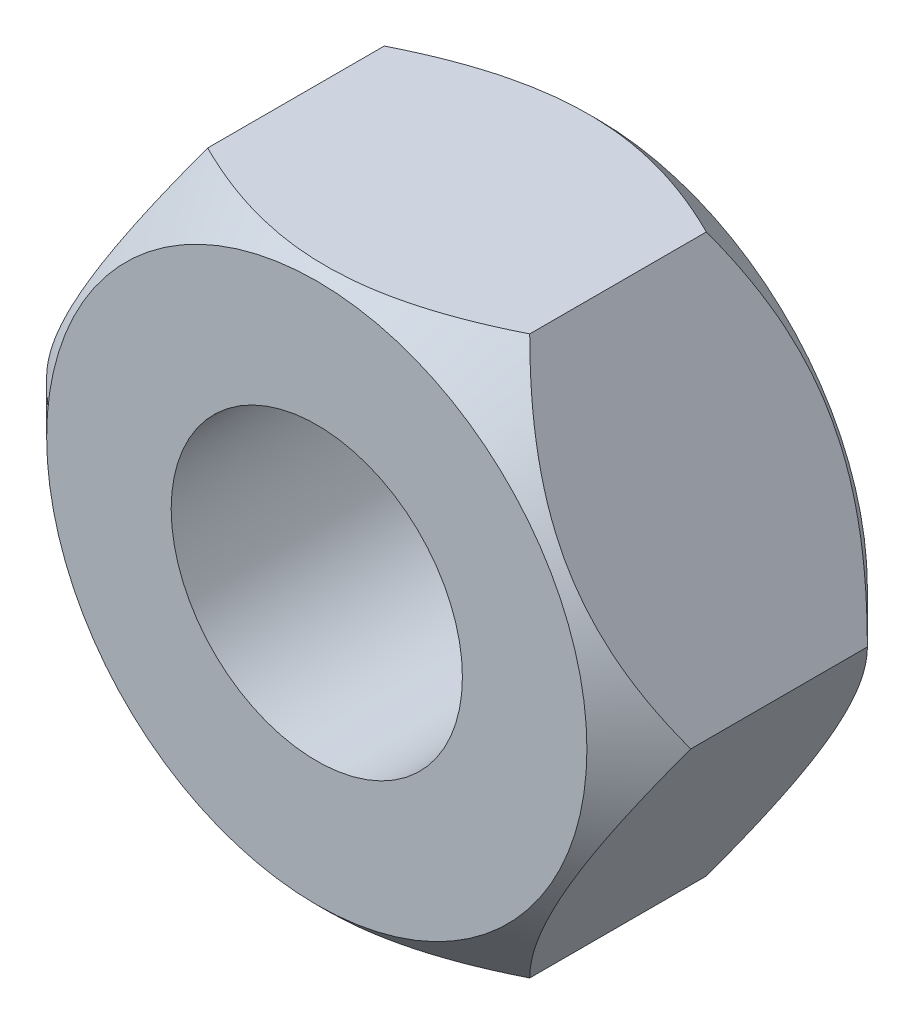
ISO-10303-21;
HEADER;
FILE_DESCRIPTION(('STEP AP214'),'2;1');
FILE_NAME('part.step','',(''),(''),'','','');
FILE_SCHEMA(('AUTOMOTIVE_DESIGN { 1 0 10303 214 1 1 1 1 }'));
ENDSEC;
DATA;
#1=APPLICATION_CONTEXT('core data for automotive mechanical design processes');
#2=APPLICATION_PROTOCOL_DEFINITION('international standard','automotive_design',2000,#1);
#3=PRODUCT_CONTEXT('',#1,'mechanical');
#4=PRODUCT('Part','Part','',(#3));
#5=PRODUCT_RELATED_PRODUCT_CATEGORY('part','',(#4));
#6=PRODUCT_DEFINITION_FORMATION('','',#4);
#7=PRODUCT_DEFINITION_CONTEXT('part definition',#1,'design');
#8=PRODUCT_DEFINITION('design','',#6,#7);
#9=PRODUCT_DEFINITION_SHAPE('','',#8);
#10=(LENGTH_UNIT() NAMED_UNIT(*) SI_UNIT(.MILLI.,.METRE.));
#11=(NAMED_UNIT(*) PLANE_ANGLE_UNIT() SI_UNIT($,.RADIAN.));
#12=(NAMED_UNIT(*) SI_UNIT($,.STERADIAN.) SOLID_ANGLE_UNIT());
#13=UNCERTAINTY_MEASURE_WITH_UNIT(LENGTH_MEASURE(1.E-05),#10,'distance_accuracy_value','');
#14=(GEOMETRIC_REPRESENTATION_CONTEXT(3) GLOBAL_UNCERTAINTY_ASSIGNED_CONTEXT((#13)) GLOBAL_UNIT_ASSIGNED_CONTEXT((#10,
#11,#12)) REPRESENTATION_CONTEXT('',''));
#15=CARTESIAN_POINT('',(0.,0.,0.));
#16=DIRECTION('',(0.,0.,1.));
#17=DIRECTION('',(1.,0.,0.));
#18=AXIS2_PLACEMENT_3D('',#15,#16,#17);
#19=CARTESIAN_POINT('',(0.,12.7305734356312,-3.2));
#20=DIRECTION('',(0.,0.,-1.));
#21=DIRECTION('',(-1.,0.,0.));
#22=AXIS2_PLACEMENT_3D('',#19,#20,#21);
#23=PLANE('',#22);
#24=CARTESIAN_POINT('',(0.,0.,-3.2));
#25=DIRECTION('',(0.,0.,-1.));
#26=DIRECTION('',(-1.,0.,0.));
#27=AXIS2_PLACEMENT_3D('',#24,#25,#26);
#28=CIRCLE('',#27,3.32350000000001);
#29=CARTESIAN_POINT('',(-3.32350000000001,0.,-3.2));
#30=VERTEX_POINT('',#29);
#31=EDGE_CURVE('E437',#30,#30,#28,.T.);
#32=ORIENTED_EDGE('',*,*,#31,.F.);
#33=EDGE_LOOP('',(#32));
#34=FACE_BOUND('',#33,.T.);
#35=CARTESIAN_POINT('',(0.,0.,-3.2));
#36=DIRECTION('',(0.,0.,-1.));
#37=DIRECTION('',(-1.,0.,0.));
#38=AXIS2_PLACEMENT_3D('',#35,#36,#37);
#39=CIRCLE('',#38,6.16528671781563);
#40=CARTESIAN_POINT('',(-6.16528671781562,0.,-3.2));
#41=VERTEX_POINT('',#40);
#42=EDGE_CURVE('E52',#41,#41,#39,.F.);
#43=ORIENTED_EDGE('',*,*,#42,.F.);
#44=EDGE_LOOP('',(#43));
#45=FACE_BOUND('',#44,.T.);
#46=ADVANCED_FACE('F48',(#34,#45),#23,.T.);
#47=CARTESIAN_POINT('',(0.,0.,-4.41421356237309));
#48=DIRECTION('',(0.,0.,1.));
#49=DIRECTION('',(1.,0.,0.));
#50=AXIS2_PLACEMENT_3D('',#47,#48,#49);
#51=CONICAL_SURFACE('',#50,4.95107315544253,0.785398163397448);
#52=CARTESIAN_POINT('',(-7.76238511153342,-6.36528671781563,0.673214047724806));
#53=CARTESIAN_POINT('',(-7.57520229334684,-6.36528671781563,0.52850517565176));
#54=CARTESIAN_POINT('',(-7.38702153666975,-6.36528671781563,0.385067057126823));
#55=CARTESIAN_POINT('',(-7.00825250574306,-6.36528671781563,0.101315942705855));
#56=CARTESIAN_POINT('',(-6.81766368110091,-6.36528671781563,-0.0389963177212883));
#57=CARTESIAN_POINT('',(-6.43227537100412,-6.36528671781563,-0.316910199211171));
#58=CARTESIAN_POINT('',(-6.23745476162188,-6.36528671781563,-0.454482622167092));
#59=CARTESIAN_POINT('',(-5.84458969450331,-6.36528671781563,-0.724928509042763));
#60=CARTESIAN_POINT('',(-5.64654545877006,-6.36528671781563,-0.857802294563289));
#61=CARTESIAN_POINT('',(-5.23365974744603,-6.36528671781563,-1.12624119504319));
#62=CARTESIAN_POINT('',(-5.01856443197393,-6.36528671781563,-1.26141783143151));
#63=CARTESIAN_POINT('',(-4.58331700025617,-6.36528671781563,-1.52350958302549));
#64=CARTESIAN_POINT('',(-4.36316402834724,-6.36528671781563,-1.65042328615959));
#65=CARTESIAN_POINT('',(-3.91771948944952,-6.36528671781563,-1.89329624370996));
#66=CARTESIAN_POINT('',(-3.6924455771355,-6.36528671781563,-2.00928762484668));
#67=CARTESIAN_POINT('',(-3.23547185904979,-6.36528671781563,-2.22771689283654));
#68=CARTESIAN_POINT('',(-3.00377518046011,-6.36528671781563,-2.3301612401241));
#69=CARTESIAN_POINT('',(-2.55769774177556,-6.36528671781563,-2.50807699856079));
#70=CARTESIAN_POINT('',(-2.34399906607956,-6.36528671781562,-2.58524123881317));
#71=CARTESIAN_POINT('',(-1.91107784413825,-6.36528671781562,-2.72247186545491));
#72=CARTESIAN_POINT('',(-1.69185495373321,-6.36528671781562,-2.78253718369693));
#73=CARTESIAN_POINT('',(-1.25306100869839,-6.36528671781562,-2.88128416305542));
#74=CARTESIAN_POINT('',(-1.03358025662511,-6.36528671781562,-2.9203602947243));
#75=CARTESIAN_POINT('',(-0.591790167533705,-6.36528671781562,-2.97629990355305));
#76=CARTESIAN_POINT('',(-0.36948145787447,-6.36528671781562,-2.99316822346708));
#77=CARTESIAN_POINT('',(0.0654621048721111,-6.36528671781562,-3.00320617566351));
#78=CARTESIAN_POINT('',(0.278072838541162,-6.36528671781562,-2.99742760010155));
#79=CARTESIAN_POINT('',(0.701676425638989,-6.36528671781562,-2.96492714161134));
#80=CARTESIAN_POINT('',(0.912669133491356,-6.36528671781562,-2.93820339602699));
#81=CARTESIAN_POINT('',(1.33508891098892,-6.36528671781562,-2.86488380431923));
#82=CARTESIAN_POINT('',(1.5464534075807,-6.36528671781562,-2.81793360487504));
#83=CARTESIAN_POINT('',(1.96451234475091,-6.36528671781562,-2.70679337960762));
#84=CARTESIAN_POINT('',(2.17120701451626,-6.36528671781562,-2.64260420184455));
#85=CARTESIAN_POINT('',(2.58952534362606,-6.36528671781562,-2.49635484461017));
#86=CARTESIAN_POINT('',(2.80089358398573,-6.36528671781562,-2.41357260180954));
#87=CARTESIAN_POINT('',(3.21820401991109,-6.36528671781562,-2.2352027972607));
#88=CARTESIAN_POINT('',(3.42414373808872,-6.36528671781562,-2.13960950605476));
#89=CARTESIAN_POINT('',(3.83156235741431,-6.36528671781562,-1.9378833447665));
#90=CARTESIAN_POINT('',(4.03302513083261,-6.36528671781562,-1.83171816708422));
#91=CARTESIAN_POINT('',(4.43133833300465,-6.36528671781562,-1.61118216748763));
#92=CARTESIAN_POINT('',(4.62818946059477,-6.36528671781562,-1.49681259965485));
#93=CARTESIAN_POINT('',(5.00827074323468,-6.36528671781562,-1.26727075127695));
#94=CARTESIAN_POINT('',(5.19169384661193,-6.36528671781562,-1.15241627076983));
#95=CARTESIAN_POINT('',(5.55538833501125,-6.36528671781562,-0.917806765919314));
#96=CARTESIAN_POINT('',(5.73565948292346,-6.36528671781562,-0.798051375143196));
#97=CARTESIAN_POINT('',(6.09201602604293,-6.36528671781562,-0.555485277573426));
#98=CARTESIAN_POINT('',(6.26812337930183,-6.36528671781562,-0.432706713539862));
#99=CARTESIAN_POINT('',(6.6179203573018,-6.36528671781562,-0.183849413140996));
#100=CARTESIAN_POINT('',(6.79161063531104,-6.36528671781562,-0.0577715960910986));
#101=CARTESIAN_POINT('',(6.96428662494657,-6.36528671781562,0.0696570125099407));
#102=B_SPLINE_CURVE_WITH_KNOTS('',3,(#52,#53,#54,#55,#56,#57,#58,#59,#60,#61,#62,#63,#64,#65,
#66,#67,#68,#69,#70,#71,#72,#73,#74,#75,#76,#77,#78,#79,#80,#81,#82,#83,#84,#85,#86,#87,#88,#89,
#90,#91,#92,#93,#94,#95,#96,#97,#98,#99,#100,#101),.UNSPECIFIED.,.F.,.F.,(4,2,2,2,2,2,2,2,2,2,2,
2,2,2,2,2,2,2,2,2,2,2,2,2,4),(0.,0.709803276707006,1.41977183266255,2.13520817681282,
2.85059545737842,3.61258204363045,4.37469850755869,5.13449828098337,5.89393439723402,
6.57496032504066,7.2560287863172,7.92380464147173,8.59143485372003,9.22843407884403,
9.86548995880247,10.5141919379485,11.162862010473,11.8433450682876,12.5241334790443,
13.2070702408519,13.88990283393,14.5390575260462,15.1882608433485,15.8322658485392,
16.4760932775642),.UNSPECIFIED.);
#103=CARTESIAN_POINT('',(3.675,-6.36528671781562,-2.01528671781563));
#104=VERTEX_POINT('',#103);
#105=CARTESIAN_POINT('',(-3.675,-6.36528671781562,-2.01528671781562));
#106=VERTEX_POINT('',#105);
#107=EDGE_CURVE('E100',#104,#106,#102,.F.);
#108=ORIENTED_EDGE('',*,*,#107,.T.);
#109=CARTESIAN_POINT('',(-3.67488452994616,-6.36548671781563,-2.01517124504074));
#110=CARTESIAN_POINT('',(-3.73807356401795,-6.25604010032207,-2.07835377232718));
#111=CARTESIAN_POINT('',(-3.80174829849817,-6.14575222504388,-2.13959731862921));
#112=CARTESIAN_POINT('',(-3.93016445452812,-5.92332891828732,-2.25761662143914));
#113=CARTESIAN_POINT('',(-3.99490643564212,-5.8111925176152,-2.31438993784469));
#114=CARTESIAN_POINT('',(-4.19147763596966,-5.4707212113431,-2.47760393260829));
#115=CARTESIAN_POINT('',(-4.32497092023566,-5.23950406052515,-2.57624238755673));
#116=CARTESIAN_POINT('',(-4.59417079829745,-4.77323619433079,-2.74515392307455));
#117=CARTESIAN_POINT('',(-4.72980858778119,-4.53830465151862,-2.81585254576234));
#118=CARTESIAN_POINT('',(-4.93549518694531,-4.1820450113303,-2.89763346727766));
#119=CARTESIAN_POINT('',(-5.00436021084379,-4.0627672910737,-2.92083833579857));
#120=CARTESIAN_POINT('',(-5.14267334083861,-3.82320192256878,-2.95863396667905));
#121=CARTESIAN_POINT('',(-5.21212135822206,-3.70291442797573,-2.97322601637104));
#122=CARTESIAN_POINT('',(-5.3813568074318,-3.40979003150271,-2.99769169950192));
#123=CARTESIAN_POINT('',(-5.48132658374675,-3.23663729970392,-3.00282504103294));
#124=CARTESIAN_POINT('',(-5.6810859539133,-2.8906439212875,-2.99420887105415));
#125=CARTESIAN_POINT('',(-5.78087547232866,-2.71780340532926,-2.98045274040005));
#126=CARTESIAN_POINT('',(-5.97951370766255,-2.37375188940515,-2.93486849774483));
#127=CARTESIAN_POINT('',(-6.07836124658407,-2.20254292978993,-2.90302017596468));
#128=CARTESIAN_POINT('',(-6.27435737582576,-1.86306767585649,-2.82298302590451));
#129=CARTESIAN_POINT('',(-6.37150609582014,-1.69480115693594,-2.77479545060811));
#130=CARTESIAN_POINT('',(-6.54396205260882,-1.39609867771004,-2.6756590707861));
#131=CARTESIAN_POINT('',(-6.61965116767066,-1.26500128484302,-2.62731757439736));
#132=CARTESIAN_POINT('',(-6.76967069700655,-1.00515983790569,-2.52284454499592));
#133=CARTESIAN_POINT('',(-6.8440010700074,-0.876415855322655,-2.46671277578916));
#134=CARTESIAN_POINT('',(-6.99106899949014,-0.621686729294596,-2.34791745948314));
#135=CARTESIAN_POINT('',(-7.0638107386559,-0.495694341228572,-2.2852744534155));
#136=CARTESIAN_POINT('',(-7.20794725011016,-0.246042580164072,-2.15427908651923));
#137=CARTESIAN_POINT('',(-7.27934281597615,-0.122381832649047,-2.08593022708493));
#138=CARTESIAN_POINT('',(-7.35011547005384,0.000200000000004609,-2.01517124504074));
#139=B_SPLINE_CURVE_WITH_KNOTS('',3,(#109,#110,#111,#112,#113,#114,#115,#116,#117,#118,#119,
#120,#121,#122,#123,#124,#125,#126,#127,#128,#129,#130,#131,#132,#133,#134,#135,#136,#137,#138),
.UNSPECIFIED.,.F.,.F.,(4,2,2,2,2,2,2,2,2,2,2,2,2,2,4),(0.,0.423851395527622,0.847932571714284,
1.70067337750543,2.53987353572585,2.95865059939789,3.37736505384643,3.97644909130097,
4.5757431100471,5.17570788684627,5.77562666545544,6.25213187254105,6.72865152999374,
7.20371108313857,7.67848122942596),.UNSPECIFIED.);
#140=CARTESIAN_POINT('',(-7.35,0.,-2.01528671781563));
#141=VERTEX_POINT('',#140);
#142=EDGE_CURVE('E72',#106,#141,#139,.T.);
#143=ORIENTED_EDGE('',*,*,#142,.T.);
#144=CARTESIAN_POINT('',(-7.35011547005384,-0.000199999999995818,-2.01517124504074));
#145=CARTESIAN_POINT('',(-7.28692643598204,0.109246617493558,-2.07835377232718));
#146=CARTESIAN_POINT('',(-7.22325170150182,0.219534492771754,-2.13959731862922));
#147=CARTESIAN_POINT('',(-7.09483554547187,0.441957799528313,-2.25761662143915));
#148=CARTESIAN_POINT('',(-7.03009356435787,0.554094200200429,-2.31438993784469));
#149=CARTESIAN_POINT('',(-6.83352236403033,0.894565506472534,-2.47760393260829));
#150=CARTESIAN_POINT('',(-6.70002907976433,1.12578265729048,-2.57624238755673));
#151=CARTESIAN_POINT('',(-6.43082920170254,1.59205052348484,-2.74515392307456));
#152=CARTESIAN_POINT('',(-6.2951914122188,1.82698206629701,-2.81585254576234));
#153=CARTESIAN_POINT('',(-6.08950481305468,2.18324170648532,-2.89763346727766));
#154=CARTESIAN_POINT('',(-6.0206397891562,2.30251942674193,-2.92083833579857));
#155=CARTESIAN_POINT('',(-5.88232665916138,2.54208479524684,-2.95863396667905));
#156=CARTESIAN_POINT('',(-5.81287864177793,2.6623722898399,-2.97322601637104));
#157=CARTESIAN_POINT('',(-5.64364319256819,2.95549668631292,-2.99769169950192));
#158=CARTESIAN_POINT('',(-5.54367341625324,3.12864941811171,-3.00282504103294));
#159=CARTESIAN_POINT('',(-5.34391404608669,3.47464279652813,-2.99420887105415));
#160=CARTESIAN_POINT('',(-5.24412452767133,3.64748331248636,-2.98045274040005));
#161=CARTESIAN_POINT('',(-5.04548629233744,3.99153482841048,-2.93486849774483));
#162=CARTESIAN_POINT('',(-4.94663875341592,4.1627437880257,-2.90302017596469));
#163=CARTESIAN_POINT('',(-4.75064262417423,4.50221904195913,-2.82298302590451));
#164=CARTESIAN_POINT('',(-4.65349390417985,4.67048556087968,-2.77479545060811));
#165=CARTESIAN_POINT('',(-4.48103794739117,4.96918804010558,-2.6756590707861));
#166=CARTESIAN_POINT('',(-4.40534883232934,5.10028543297261,-2.62731757439736));
#167=CARTESIAN_POINT('',(-4.25532930299345,5.36012687990994,-2.52284454499593));
#168=CARTESIAN_POINT('',(-4.18099892999259,5.48887086249297,-2.46671277578916));
#169=CARTESIAN_POINT('',(-4.03393100050985,5.74359998852102,-2.34791745948314));
#170=CARTESIAN_POINT('',(-3.96118926134409,5.86959237658705,-2.2852744534155));
#171=CARTESIAN_POINT('',(-3.81705274988984,6.11924413765155,-2.15427908651924));
#172=CARTESIAN_POINT('',(-3.74565718402385,6.24290488516657,-2.08593022708493));
#173=CARTESIAN_POINT('',(-3.67488452994616,6.36548671781562,-2.01517124504075));
#174=B_SPLINE_CURVE_WITH_KNOTS('',3,(#144,#145,#146,#147,#148,#149,#150,#151,#152,#153,#154,
#155,#156,#157,#158,#159,#160,#161,#162,#163,#164,#165,#166,#167,#168,#169,#170,#171,#172,#173),
.UNSPECIFIED.,.F.,.F.,(4,2,2,2,2,2,2,2,2,2,2,2,2,2,4),(0.,0.423851395527623,0.847932571714286,
1.70067337750543,2.53987353572585,2.95865059939789,3.37736505384643,3.97644909130097,
4.5757431100471,5.17570788684626,5.77562666545544,6.25213187254105,6.72865152999373,
7.20371108313856,7.67848122942594),.UNSPECIFIED.);
#175=CARTESIAN_POINT('',(-3.675,6.36528671781562,-2.01528671781563));
#176=VERTEX_POINT('',#175);
#177=EDGE_CURVE('E194',#141,#176,#174,.T.);
#178=ORIENTED_EDGE('',*,*,#177,.T.);
#179=CARTESIAN_POINT('',(-7.76238375890239,6.36528671781562,0.673213001787473));
#180=CARTESIAN_POINT('',(-7.57520098003128,6.36528671781562,0.528504170242677));
#181=CARTESIAN_POINT('',(-7.38702026278454,6.36528671781562,0.385066092188966));
#182=CARTESIAN_POINT('',(-7.00825131108923,6.36528671781562,0.101315058480191));
#183=CARTESIAN_POINT('',(-6.81766252624821,6.36528671781562,-0.0389971617060863));
#184=CARTESIAN_POINT('',(-6.43227429705411,6.36528671781562,-0.316910962411911));
#185=CARTESIAN_POINT('',(-6.23745372878444,6.36528671781562,-0.454483344837488));
#186=CARTESIAN_POINT('',(-5.84458874459149,6.36528671781562,-0.724929151277076));
#187=CARTESIAN_POINT('',(-5.64654455067117,6.36528671781562,-0.857802896891723));
#188=CARTESIAN_POINT('',(-5.23365892964003,6.36528671781562,-1.12624171403129));
#189=CARTESIAN_POINT('',(-5.01856366277229,6.36528671781562,-1.26141830713973));
#190=CARTESIAN_POINT('',(-4.58331632997627,6.36528671781562,-1.52350997412007));
#191=CARTESIAN_POINT('',(-4.36316340838556,6.36528671781562,-1.65042363592165));
#192=CARTESIAN_POINT('',(-3.91771897192037,6.36528671781562,-1.89329651418357));
#193=CARTESIAN_POINT('',(-3.69244511170579,6.36528671781562,-2.00928785734042));
#194=CARTESIAN_POINT('',(-3.23547150065858,6.36528671781562,-2.22771705412872));
#195=CARTESIAN_POINT('',(-3.00377487700457,6.36528671781562,-2.33016136818822));
#196=CARTESIAN_POINT('',(-2.55769746121548,6.36528671781562,-2.50807710416005));
#197=CARTESIAN_POINT('',(-2.34399875090591,6.36528671781562,-2.58524134889741));
#198=CARTESIAN_POINT('',(-1.91107745835378,6.36528671781562,-2.72247197757596));
#199=CARTESIAN_POINT('',(-1.69185453195287,6.36528671781562,-2.78253729337395));
#200=CARTESIAN_POINT('',(-1.25306051599569,6.36528671781562,-2.88128425948038));
#201=CARTESIAN_POINT('',(-1.03357972902538,6.36528671781562,-2.92036038058372));
#202=CARTESIAN_POINT('',(-0.591789571023439,6.36528671781562,-2.97629996005821));
#203=CARTESIAN_POINT('',(-0.369480827350671,6.36528671781562,-2.99316826118654));
#204=CARTESIAN_POINT('',(0.0654627923157916,6.36528671781562,-3.00320616941619));
#205=CARTESIAN_POINT('',(0.27807354897927,6.36528671781562,-2.99742756972882));
#206=CARTESIAN_POINT('',(0.701677179398343,6.36528671781562,-2.9649270596311));
#207=CARTESIAN_POINT('',(0.912669907577058,6.36528671781562,-2.93820328656141));
#208=CARTESIAN_POINT('',(1.33508972519046,6.36528671781562,-2.86488363762299));
#209=CARTESIAN_POINT('',(1.546454241496,6.36528671781562,-2.81793340824791));
#210=CARTESIAN_POINT('',(1.96451321591809,6.36528671781562,-2.70679312291376));
#211=CARTESIAN_POINT('',(2.17120790322185,6.36528671781562,-2.64260391501559));
#212=CARTESIAN_POINT('',(2.58952633466741,6.36528671781562,-2.49635447306527));
#213=CARTESIAN_POINT('',(2.8008946579818,6.36528671781562,-2.41357217071112));
#214=CARTESIAN_POINT('',(3.21820525559762,6.36528671781562,-2.23520224111253));
#215=CARTESIAN_POINT('',(3.42414505250726,6.36528671781562,-2.1396088844036));
#216=CARTESIAN_POINT('',(3.83156382646067,6.36528671781562,-1.93788258814053));
#217=CARTESIAN_POINT('',(4.03302667575874,6.36528671781562,-1.8317173409637));
#218=CARTESIAN_POINT('',(4.43134002720123,6.36528671781562,-1.61118120019491));
#219=CARTESIAN_POINT('',(4.628191228183,6.36528671781562,-1.49681156068588));
#220=CARTESIAN_POINT('',(5.00827264396825,6.36528671781562,-1.26726957626059));
#221=CARTESIAN_POINT('',(5.19169580734606,6.36528671781562,-1.15241503171182));
#222=CARTESIAN_POINT('',(5.55539041488355,6.36528671781562,-0.91780539850549));
#223=CARTESIAN_POINT('',(5.73566162193332,6.36528671781562,-0.798049943415196));
#224=CARTESIAN_POINT('',(6.09201828188504,6.36528671781562,-0.55548371794631));
#225=CARTESIAN_POINT('',(6.26812569284923,6.36528671781562,-0.432705090336916));
#226=CARTESIAN_POINT('',(6.61792278587736,6.36528671781562,-0.183847662867577));
#227=CARTESIAN_POINT('',(6.79161312120942,6.36528671781562,-0.0577697823227719));
#228=CARTESIAN_POINT('',(6.96428916806874,6.36528671781562,0.0696588896841598));
#229=B_SPLINE_CURVE_WITH_KNOTS('',3,(#179,#180,#181,#182,#183,#184,#185,#186,#187,#188,#189,
#190,#191,#192,#193,#194,#195,#196,#197,#198,#199,#200,#201,#202,#203,#204,#205,#206,#207,#208,
#209,#210,#211,#212,#213,#214,#215,#216,#217,#218,#219,#220,#221,#222,#223,#224,#225,#226,#227,
#228),.UNSPECIFIED.,.F.,.F.,(4,2,2,2,2,2,2,2,2,2,2,2,2,2,2,2,2,2,2,2,2,2,2,2,4),(0.,
0.709803109027238,1.41977149725395,2.13520767051967,2.85059478022713,3.612581173966,
4.37469744526365,5.1344970276959,5.89393295327698,6.57495898293922,7.25602754589564,
7.92380349794466,8.59143380702983,9.22843310276562,9.86548905343174,10.5141911097515,
11.1628612594185,11.8433446137067,12.5241333212899,13.2070703816062,13.8899032730604,
14.5390582197122,15.1882617915671,15.8322670478589,16.4760947279634),.UNSPECIFIED.);
#230=CARTESIAN_POINT('',(3.675,6.36528671781562,-2.01528671781563));
#231=VERTEX_POINT('',#230);
#232=EDGE_CURVE('E191',#176,#231,#229,.T.);
#233=ORIENTED_EDGE('',*,*,#232,.T.);
#234=CARTESIAN_POINT('',(3.67488452994616,6.36548671781562,-2.01517124504075));
#235=CARTESIAN_POINT('',(3.73807356401796,6.25604010032207,-2.07835377232719));
#236=CARTESIAN_POINT('',(3.80174829849818,6.14575222504387,-2.13959731862922));
#237=CARTESIAN_POINT('',(3.93016445452812,5.92332891828732,-2.25761662143915));
#238=CARTESIAN_POINT('',(3.99490643564212,5.8111925176152,-2.31438993784469));
#239=CARTESIAN_POINT('',(4.19147763596967,5.4707212113431,-2.47760393260829));
#240=CARTESIAN_POINT('',(4.32497092023567,5.23950406052515,-2.57624238755673));
#241=CARTESIAN_POINT('',(4.59417079829745,4.77323619433079,-2.74515392307456));
#242=CARTESIAN_POINT('',(4.72980858778119,4.53830465151862,-2.81585254576234));
#243=CARTESIAN_POINT('',(4.93549518694531,4.18204501133031,-2.89763346727767));
#244=CARTESIAN_POINT('',(5.00436021084379,4.0627672910737,-2.92083833579858));
#245=CARTESIAN_POINT('',(5.14267334083861,3.82320192256879,-2.95863396667906));
#246=CARTESIAN_POINT('',(5.21212135822206,3.70291442797573,-2.97322601637105));
#247=CARTESIAN_POINT('',(5.3813568074318,3.40979003150272,-2.99769169950192));
#248=CARTESIAN_POINT('',(5.48132658374675,3.23663729970393,-3.00282504103295));
#249=CARTESIAN_POINT('',(5.6810859539133,2.8906439212875,-2.99420887105415));
#250=CARTESIAN_POINT('',(5.78087547232866,2.71780340532927,-2.98045274040005));
#251=CARTESIAN_POINT('',(5.97951370766255,2.37375188940515,-2.93486849774483));
#252=CARTESIAN_POINT('',(6.07836124658407,2.20254292978993,-2.90302017596469));
#253=CARTESIAN_POINT('',(6.27435737582576,1.8630676758565,-2.82298302590452));
#254=CARTESIAN_POINT('',(6.37150609582014,1.69480115693595,-2.77479545060811));
#255=CARTESIAN_POINT('',(6.54396205260882,1.39609867771005,-2.6756590707861));
#256=CARTESIAN_POINT('',(6.61965116767065,1.26500128484303,-2.62731757439736));
#257=CARTESIAN_POINT('',(6.76967069700655,1.00515983790569,-2.52284454499593));
#258=CARTESIAN_POINT('',(6.8440010700074,0.876415855322662,-2.46671277578917));
#259=CARTESIAN_POINT('',(6.99106899949014,0.621686729294602,-2.34791745948314));
#260=CARTESIAN_POINT('',(7.06381073865591,0.495694341228577,-2.2852744534155));
#261=CARTESIAN_POINT('',(7.20794725011016,0.246042580164075,-2.15427908651924));
#262=CARTESIAN_POINT('',(7.27934281597615,0.122381832649049,-2.08593022708493));
#263=CARTESIAN_POINT('',(7.35011547005384,-0.000200000000002496,-2.01517124504075));
#264=B_SPLINE_CURVE_WITH_KNOTS('',3,(#234,#235,#236,#237,#238,#239,#240,#241,#242,#243,#244,
#245,#246,#247,#248,#249,#250,#251,#252,#253,#254,#255,#256,#257,#258,#259,#260,#261,#262,#263),
.UNSPECIFIED.,.F.,.F.,(4,2,2,2,2,2,2,2,2,2,2,2,2,2,4),(0.,0.423851395527621,0.847932571714284,
1.70067337750543,2.53987353572585,2.95865059939788,3.37736505384642,3.97644909130096,
4.57574311004709,5.17570788684625,5.77562666545543,6.25213187254104,6.72865152999373,
7.20371108313857,7.67848122942595),.UNSPECIFIED.);
#265=CARTESIAN_POINT('',(7.35,0.,-2.01528671781563));
#266=VERTEX_POINT('',#265);
#267=EDGE_CURVE('E195',#231,#266,#264,.T.);
#268=ORIENTED_EDGE('',*,*,#267,.T.);
#269=CARTESIAN_POINT('',(7.35011547005384,0.000199999999998205,-2.01517124504075));
#270=CARTESIAN_POINT('',(7.28692643598204,-0.109246617493556,-2.07835377232719));
#271=CARTESIAN_POINT('',(7.22325170150182,-0.219534492771752,-2.13959731862922));
#272=CARTESIAN_POINT('',(7.09483554547188,-0.441957799528309,-2.25761662143915));
#273=CARTESIAN_POINT('',(7.03009356435787,-0.554094200200424,-2.31438993784469));
#274=CARTESIAN_POINT('',(6.83352236403033,-0.894565506472528,-2.47760393260829));
#275=CARTESIAN_POINT('',(6.70002907976433,-1.12578265729047,-2.57624238755673));
#276=CARTESIAN_POINT('',(6.43082920170255,-1.59205052348483,-2.74515392307456));
#277=CARTESIAN_POINT('',(6.29519141221881,-1.826982066297,-2.81585254576234));
#278=CARTESIAN_POINT('',(6.08950481305468,-2.18324170648531,-2.89763346727766));
#279=CARTESIAN_POINT('',(6.02063978915621,-2.30251942674192,-2.92083833579857));
#280=CARTESIAN_POINT('',(5.88232665916138,-2.54208479524683,-2.95863396667905));
#281=CARTESIAN_POINT('',(5.81287864177794,-2.66237228983989,-2.97322601637104));
#282=CARTESIAN_POINT('',(5.6436431925682,-2.95549668631291,-2.99769169950192));
#283=CARTESIAN_POINT('',(5.54367341625325,-3.12864941811169,-3.00282504103294));
#284=CARTESIAN_POINT('',(5.34391404608669,-3.47464279652812,-2.99420887105415));
#285=CARTESIAN_POINT('',(5.24412452767133,-3.64748331248635,-2.98045274040005));
#286=CARTESIAN_POINT('',(5.04548629233745,-3.99153482841047,-2.93486849774483));
#287=CARTESIAN_POINT('',(4.94663875341593,-4.16274378802569,-2.90302017596469));
#288=CARTESIAN_POINT('',(4.75064262417424,-4.50221904195912,-2.82298302590452));
#289=CARTESIAN_POINT('',(4.65349390417986,-4.67048556087967,-2.77479545060811));
#290=CARTESIAN_POINT('',(4.48103794739118,-4.96918804010557,-2.6756590707861));
#291=CARTESIAN_POINT('',(4.40534883232934,-5.10028543297259,-2.62731757439736));
#292=CARTESIAN_POINT('',(4.25532930299345,-5.36012687990993,-2.52284454499593));
#293=CARTESIAN_POINT('',(4.18099892999259,-5.48887086249296,-2.46671277578916));
#294=CARTESIAN_POINT('',(4.03393100050986,-5.74359998852102,-2.34791745948314));
#295=CARTESIAN_POINT('',(3.96118926134409,-5.86959237658704,-2.2852744534155));
#296=CARTESIAN_POINT('',(3.81705274988984,-6.11924413765154,-2.15427908651923));
#297=CARTESIAN_POINT('',(3.74565718402385,-6.24290488516657,-2.08593022708493));
#298=CARTESIAN_POINT('',(3.67488452994616,-6.36548671781562,-2.01517124504074));
#299=B_SPLINE_CURVE_WITH_KNOTS('',3,(#269,#270,#271,#272,#273,#274,#275,#276,#277,#278,#279,
#280,#281,#282,#283,#284,#285,#286,#287,#288,#289,#290,#291,#292,#293,#294,#295,#296,#297,#298),
.UNSPECIFIED.,.F.,.F.,(4,2,2,2,2,2,2,2,2,2,2,2,2,2,4),(0.,0.42385139552762,0.847932571714281,
1.70067337750543,2.53987353572584,2.95865059939787,3.37736505384642,3.97644909130096,
4.57574311004708,5.17570788684625,5.77562666545542,6.25213187254104,6.72865152999372,
7.20371108313856,7.67848122942594),.UNSPECIFIED.);
#300=EDGE_CURVE('E104',#266,#104,#299,.T.);
#301=ORIENTED_EDGE('',*,*,#300,.T.);
#302=EDGE_LOOP('',(#108,#143,#178,#233,#268,#301));
#303=FACE_BOUND('',#302,.T.);
#304=ORIENTED_EDGE('',*,*,#42,.T.);
#305=EDGE_LOOP('',(#304));
#306=FACE_BOUND('',#305,.T.);
#307=ADVANCED_FACE('F101',(#303,#306),#51,.T.);
#308=CARTESIAN_POINT('',(-7.35,0.,3.2));
#309=DIRECTION('',(-0.866025403784438,0.5,0.));
#310=DIRECTION('',(-0.5,-0.866025403784438,0.));
#311=AXIS2_PLACEMENT_3D('',#308,#309,#310);
#312=PLANE('',#311);
#313=CARTESIAN_POINT('',(-3.67488452994616,6.36548671781562,2.01517124504075));
#314=CARTESIAN_POINT('',(-3.73807356401796,6.25604010032207,2.07835377232719));
#315=CARTESIAN_POINT('',(-3.80174829849818,6.14575222504387,2.13959731862922));
#316=CARTESIAN_POINT('',(-3.93016445452812,5.92332891828731,2.25761662143915));
#317=CARTESIAN_POINT('',(-3.99490643564212,5.8111925176152,2.31438993784469));
#318=CARTESIAN_POINT('',(-4.19147763596967,5.47072121134309,2.47760393260829));
#319=CARTESIAN_POINT('',(-4.32497092023566,5.23950406052515,2.57624238755673));
#320=CARTESIAN_POINT('',(-4.59417079829745,4.77323619433079,2.74515392307456));
#321=CARTESIAN_POINT('',(-4.72980858778119,4.53830465151862,2.81585254576234));
#322=CARTESIAN_POINT('',(-4.93549518694531,4.18204501133031,2.89763346727766));
#323=CARTESIAN_POINT('',(-5.00436021084379,4.0627672910737,2.92083833579857));
#324=CARTESIAN_POINT('',(-5.14267334083861,3.82320192256879,2.95863396667905));
#325=CARTESIAN_POINT('',(-5.21212135822206,3.70291442797573,2.97322601637104));
#326=CARTESIAN_POINT('',(-5.38135680743181,3.40979003150271,2.99769169950192));
#327=CARTESIAN_POINT('',(-5.48132658374675,3.23663729970393,3.00282504103294));
#328=CARTESIAN_POINT('',(-5.68108595391331,2.8906439212875,2.99420887105415));
#329=CARTESIAN_POINT('',(-5.78087547232867,2.71780340532927,2.98045274040005));
#330=CARTESIAN_POINT('',(-5.97951370766255,2.37375188940515,2.93486849774483));
#331=CARTESIAN_POINT('',(-6.07836124658408,2.20254292978993,2.90302017596468));
#332=CARTESIAN_POINT('',(-6.27435737582576,1.8630676758565,2.82298302590451));
#333=CARTESIAN_POINT('',(-6.37150609582014,1.69480115693595,2.77479545060811));
#334=CARTESIAN_POINT('',(-6.54396205260882,1.39609867771005,2.6756590707861));
#335=CARTESIAN_POINT('',(-6.61965116767066,1.26500128484302,2.62731757439736));
#336=CARTESIAN_POINT('',(-6.76967069700655,1.00515983790569,2.52284454499592));
#337=CARTESIAN_POINT('',(-6.84400107000741,0.87641585532266,2.46671277578916));
#338=CARTESIAN_POINT('',(-6.99106899949014,0.621686729294603,2.34791745948314));
#339=CARTESIAN_POINT('',(-7.06381073865591,0.495694341228579,2.2852744534155));
#340=CARTESIAN_POINT('',(-7.20794725011016,0.246042580164081,2.15427908651923));
#341=CARTESIAN_POINT('',(-7.27934281597615,0.122381832649056,2.08593022708493));
#342=CARTESIAN_POINT('',(-7.35011547005384,-0.000199999999995559,2.01517124504074));
#343=B_SPLINE_CURVE_WITH_KNOTS('',3,(#313,#314,#315,#316,#317,#318,#319,#320,#321,#322,#323,
#324,#325,#326,#327,#328,#329,#330,#331,#332,#333,#334,#335,#336,#337,#338,#339,#340,#341,#342),
.UNSPECIFIED.,.F.,.F.,(4,2,2,2,2,2,2,2,2,2,2,2,2,2,4),(0.,0.423851395527621,0.847932571714282,
1.70067337750543,2.53987353572585,2.95865059939788,3.37736505384642,3.97644909130096,
4.57574311004709,5.17570788684626,5.77562666545543,6.25213187254104,6.72865152999372,
7.20371108313856,7.67848122942594),.UNSPECIFIED.);
#344=CARTESIAN_POINT('',(-3.675,6.36528671781562,2.01528671781563));
#345=VERTEX_POINT('',#344);
#346=CARTESIAN_POINT('',(-7.35,0.,2.01528671781563));
#347=VERTEX_POINT('',#346);
#348=EDGE_CURVE('E186',#345,#347,#343,.T.);
#349=ORIENTED_EDGE('',*,*,#348,.F.);
#350=DIRECTION('',(0.,0.,-1.));
#351=VECTOR('',#350,1.);
#352=CARTESIAN_POINT('',(-3.675,6.36528671781562,3.2));
#353=LINE('',#352,#351);
#354=EDGE_CURVE('E144',#345,#176,#353,.T.);
#355=ORIENTED_EDGE('',*,*,#354,.T.);
#356=ORIENTED_EDGE('',*,*,#177,.F.);
#357=DIRECTION('',(0.,0.,-1.));
#358=VECTOR('',#357,1.);
#359=CARTESIAN_POINT('',(-7.35,0.,3.2));
#360=LINE('',#359,#358);
#361=EDGE_CURVE('E117',#347,#141,#360,.T.);
#362=ORIENTED_EDGE('',*,*,#361,.F.);
#363=EDGE_LOOP('',(#349,#355,#356,#362));
#364=FACE_BOUND('',#363,.T.);
#365=ADVANCED_FACE('F163',(#364),#312,.T.);
#366=CARTESIAN_POINT('',(-3.675,6.36528671781562,3.2));
#367=DIRECTION('',(0.,1.,0.));
#368=DIRECTION('',(-1.,0.,0.));
#369=AXIS2_PLACEMENT_3D('',#366,#367,#368);
#370=PLANE('',#369);
#371=CARTESIAN_POINT('',(-7.76238375890239,6.36528671781562,-0.673213001787475));
#372=CARTESIAN_POINT('',(-7.57520098003128,6.36528671781562,-0.528504170242677));
#373=CARTESIAN_POINT('',(-7.38702026278455,6.36528671781562,-0.385066092188965));
#374=CARTESIAN_POINT('',(-7.00825131108923,6.36528671781562,-0.10131505848019));
#375=CARTESIAN_POINT('',(-6.81766252624822,6.36528671781562,0.0389971617060873));
#376=CARTESIAN_POINT('',(-6.43227429705412,6.36528671781562,0.316910962411912));
#377=CARTESIAN_POINT('',(-6.23745372878444,6.36528671781562,0.454483344837489));
#378=CARTESIAN_POINT('',(-5.84458874459149,6.36528671781562,0.724929151277077));
#379=CARTESIAN_POINT('',(-5.64654455067117,6.36528671781562,0.857802896891725));
#380=CARTESIAN_POINT('',(-5.23365892964003,6.36528671781562,1.1262417140313));
#381=CARTESIAN_POINT('',(-5.01856366277229,6.36528671781562,1.26141830713973));
#382=CARTESIAN_POINT('',(-4.58331632997627,6.36528671781562,1.52350997412007));
#383=CARTESIAN_POINT('',(-4.36316340838556,6.36528671781562,1.65042363592165));
#384=CARTESIAN_POINT('',(-3.91771897192037,6.36528671781562,1.89329651418357));
#385=CARTESIAN_POINT('',(-3.69244511170579,6.36528671781562,2.00928785734042));
#386=CARTESIAN_POINT('',(-3.23547150065858,6.36528671781562,2.22771705412872));
#387=CARTESIAN_POINT('',(-3.00377487700457,6.36528671781562,2.33016136818822));
#388=CARTESIAN_POINT('',(-2.55769746121548,6.36528671781562,2.50807710416005));
#389=CARTESIAN_POINT('',(-2.34399875090591,6.36528671781562,2.58524134889742));
#390=CARTESIAN_POINT('',(-1.91107745835379,6.36528671781562,2.72247197757596));
#391=CARTESIAN_POINT('',(-1.69185453195287,6.36528671781562,2.78253729337395));
#392=CARTESIAN_POINT('',(-1.25306051599569,6.36528671781562,2.88128425948038));
#393=CARTESIAN_POINT('',(-1.03357972902538,6.36528671781562,2.92036038058372));
#394=CARTESIAN_POINT('',(-0.591789571023439,6.36528671781562,2.97629996005821));
#395=CARTESIAN_POINT('',(-0.369480827350671,6.36528671781562,2.99316826118654));
#396=CARTESIAN_POINT('',(0.0654627923157924,6.36528671781562,3.00320616941619));
#397=CARTESIAN_POINT('',(0.27807354897927,6.36528671781562,2.99742756972882));
#398=CARTESIAN_POINT('',(0.701677179398343,6.36528671781562,2.96492705963111));
#399=CARTESIAN_POINT('',(0.912669907577059,6.36528671781562,2.93820328656141));
#400=CARTESIAN_POINT('',(1.33508972519047,6.36528671781562,2.86488363762299));
#401=CARTESIAN_POINT('',(1.54645424149601,6.36528671781562,2.81793340824791));
#402=CARTESIAN_POINT('',(1.96451321591809,6.36528671781562,2.70679312291376));
#403=CARTESIAN_POINT('',(2.17120790322185,6.36528671781562,2.64260391501559));
#404=CARTESIAN_POINT('',(2.58952633466741,6.36528671781562,2.49635447306527));
#405=CARTESIAN_POINT('',(2.8008946579818,6.36528671781562,2.41357217071112));
#406=CARTESIAN_POINT('',(3.21820525559762,6.36528671781562,2.23520224111253));
#407=CARTESIAN_POINT('',(3.42414505250726,6.36528671781562,2.1396088844036));
#408=CARTESIAN_POINT('',(3.83156382646067,6.36528671781562,1.93788258814053));
#409=CARTESIAN_POINT('',(4.03302667575874,6.36528671781562,1.8317173409637));
#410=CARTESIAN_POINT('',(4.43134002720123,6.36528671781562,1.61118120019491));
#411=CARTESIAN_POINT('',(4.628191228183,6.36528671781562,1.49681156068588));
#412=CARTESIAN_POINT('',(5.00827264396825,6.36528671781562,1.26726957626059));
#413=CARTESIAN_POINT('',(5.19169580734606,6.36528671781562,1.15241503171182));
#414=CARTESIAN_POINT('',(5.55539041488355,6.36528671781562,0.917805398505491));
#415=CARTESIAN_POINT('',(5.73566162193332,6.36528671781562,0.798049943415198));
#416=CARTESIAN_POINT('',(6.09201828188504,6.36528671781562,0.555483717946312));
#417=CARTESIAN_POINT('',(6.26812569284923,6.36528671781562,0.432705090336917));
#418=CARTESIAN_POINT('',(6.61792278587736,6.36528671781562,0.183847662867577));
#419=CARTESIAN_POINT('',(6.79161312120942,6.36528671781562,0.0577697823227715));
#420=CARTESIAN_POINT('',(6.96428916806874,6.36528671781562,-0.0696588896841601));
#421=B_SPLINE_CURVE_WITH_KNOTS('',3,(#371,#372,#373,#374,#375,#376,#377,#378,#379,#380,#381,
#382,#383,#384,#385,#386,#387,#388,#389,#390,#391,#392,#393,#394,#395,#396,#397,#398,#399,#400,
#401,#402,#403,#404,#405,#406,#407,#408,#409,#410,#411,#412,#413,#414,#415,#416,#417,#418,#419,
#420),.UNSPECIFIED.,.F.,.F.,(4,2,2,2,2,2,2,2,2,2,2,2,2,2,2,2,2,2,2,2,2,2,2,2,4),(0.,
0.709803109027241,1.41977149725395,2.13520767051967,2.85059478022714,3.61258117396601,
4.37469744526366,5.1344970276959,5.89393295327699,6.57495898293923,7.25602754589564,
7.92380349794466,8.59143380702984,9.22843310276563,9.86548905343175,10.5141911097515,
11.1628612594185,11.8433446137068,12.5241333212899,13.2070703816062,13.8899032730605,
14.5390582197122,15.1882617915671,15.8322670478589,16.4760947279634),.UNSPECIFIED.);
#422=CARTESIAN_POINT('',(3.675,6.36528671781562,2.01528671781563));
#423=VERTEX_POINT('',#422);
#424=EDGE_CURVE('E64',#423,#345,#421,.F.);
#425=ORIENTED_EDGE('',*,*,#424,.F.);
#426=DIRECTION('',(0.,0.,-1.));
#427=VECTOR('',#426,1.);
#428=CARTESIAN_POINT('',(3.675,6.36528671781562,3.2));
#429=LINE('',#428,#427);
#430=EDGE_CURVE('E140',#423,#231,#429,.T.);
#431=ORIENTED_EDGE('',*,*,#430,.T.);
#432=ORIENTED_EDGE('',*,*,#232,.F.);
#433=ORIENTED_EDGE('',*,*,#354,.F.);
#434=EDGE_LOOP('',(#425,#431,#432,#433));
#435=FACE_BOUND('',#434,.T.);
#436=ADVANCED_FACE('F170',(#435),#370,.T.);
#437=CARTESIAN_POINT('',(3.675,6.36528671781563,3.2));
#438=DIRECTION('',(0.866025403784439,0.5,0.));
#439=DIRECTION('',(-0.5,0.866025403784439,0.));
#440=AXIS2_PLACEMENT_3D('',#437,#438,#439);
#441=PLANE('',#440);
#442=CARTESIAN_POINT('',(7.35011547005384,-0.000200000000002268,2.01517124504075));
#443=CARTESIAN_POINT('',(7.28692643598204,0.109246617493552,2.07835377232718));
#444=CARTESIAN_POINT('',(7.22325170150182,0.219534492771749,2.13959731862922));
#445=CARTESIAN_POINT('',(7.09483554547188,0.441957799528306,2.25761662143915));
#446=CARTESIAN_POINT('',(7.03009356435788,0.554094200200422,2.31438993784469));
#447=CARTESIAN_POINT('',(6.83352236403033,0.894565506472526,2.47760393260829));
#448=CARTESIAN_POINT('',(6.70002907976433,1.12578265729047,2.57624238755673));
#449=CARTESIAN_POINT('',(6.43082920170254,1.59205052348484,2.74515392307456));
#450=CARTESIAN_POINT('',(6.29519141221881,1.826982066297,2.81585254576234));
#451=CARTESIAN_POINT('',(6.08950481305468,2.18324170648532,2.89763346727767));
#452=CARTESIAN_POINT('',(6.02063978915621,2.30251942674193,2.92083833579858));
#453=CARTESIAN_POINT('',(5.88232665916138,2.54208479524684,2.95863396667906));
#454=CARTESIAN_POINT('',(5.81287864177794,2.66237228983989,2.97322601637105));
#455=CARTESIAN_POINT('',(5.64364319256819,2.95549668631291,2.99769169950192));
#456=CARTESIAN_POINT('',(5.54367341625324,3.1286494181117,3.00282504103295));
#457=CARTESIAN_POINT('',(5.34391404608669,3.47464279652812,2.99420887105415));
#458=CARTESIAN_POINT('',(5.24412452767133,3.64748331248636,2.98045274040005));
#459=CARTESIAN_POINT('',(5.04548629233745,3.99153482841047,2.93486849774483));
#460=CARTESIAN_POINT('',(4.94663875341592,4.16274378802569,2.90302017596469));
#461=CARTESIAN_POINT('',(4.75064262417424,4.50221904195913,2.82298302590452));
#462=CARTESIAN_POINT('',(4.65349390417986,4.67048556087968,2.77479545060811));
#463=CARTESIAN_POINT('',(4.48103794739118,4.96918804010558,2.6756590707861));
#464=CARTESIAN_POINT('',(4.40534883232934,5.1002854329726,2.62731757439736));
#465=CARTESIAN_POINT('',(4.25532930299345,5.36012687990993,2.52284454499593));
#466=CARTESIAN_POINT('',(4.18099892999259,5.48887086249296,2.46671277578917));
#467=CARTESIAN_POINT('',(4.03393100050985,5.74359998852102,2.34791745948315));
#468=CARTESIAN_POINT('',(3.96118926134409,5.86959237658705,2.2852744534155));
#469=CARTESIAN_POINT('',(3.81705274988984,6.11924413765155,2.15427908651924));
#470=CARTESIAN_POINT('',(3.74565718402385,6.24290488516657,2.08593022708494));
#471=CARTESIAN_POINT('',(3.67488452994616,6.36548671781562,2.01517124504075));
#472=B_SPLINE_CURVE_WITH_KNOTS('',3,(#442,#443,#444,#445,#446,#447,#448,#449,#450,#451,#452,
#453,#454,#455,#456,#457,#458,#459,#460,#461,#462,#463,#464,#465,#466,#467,#468,#469,#470,#471),
.UNSPECIFIED.,.F.,.F.,(4,2,2,2,2,2,2,2,2,2,2,2,2,2,4),(0.,0.423851395527622,0.847932571714284,
1.70067337750543,2.53987353572585,2.95865059939788,3.37736505384643,3.97644909130097,
4.57574311004709,5.17570788684626,5.77562666545543,6.25213187254105,6.72865152999373,
7.20371108313857,7.67848122942595),.UNSPECIFIED.);
#473=CARTESIAN_POINT('',(7.35,0.,2.01528671781563));
#474=VERTEX_POINT('',#473);
#475=EDGE_CURVE('E252',#474,#423,#472,.T.);
#476=ORIENTED_EDGE('',*,*,#475,.F.);
#477=DIRECTION('',(0.,0.,-1.));
#478=VECTOR('',#477,1.);
#479=CARTESIAN_POINT('',(7.35,0.,3.2));
#480=LINE('',#479,#478);
#481=EDGE_CURVE('E131',#474,#266,#480,.T.);
#482=ORIENTED_EDGE('',*,*,#481,.T.);
#483=ORIENTED_EDGE('',*,*,#267,.F.);
#484=ORIENTED_EDGE('',*,*,#430,.F.);
#485=EDGE_LOOP('',(#476,#482,#483,#484));
#486=FACE_BOUND('',#485,.T.);
#487=ADVANCED_FACE('F173',(#486),#441,.T.);
#488=CARTESIAN_POINT('',(7.35,0.,3.2));
#489=DIRECTION('',(0.866025403784438,-0.5,0.));
#490=DIRECTION('',(0.5,0.866025403784439,0.));
#491=AXIS2_PLACEMENT_3D('',#488,#489,#490);
#492=PLANE('',#491);
#493=CARTESIAN_POINT('',(3.67488452994616,-6.36548671781562,2.01517124504074));
#494=CARTESIAN_POINT('',(3.73807356401796,-6.25604010032207,2.07835377232718));
#495=CARTESIAN_POINT('',(3.80174829849818,-6.14575222504387,2.13959731862922));
#496=CARTESIAN_POINT('',(3.93016445452812,-5.92332891828731,2.25761662143915));
#497=CARTESIAN_POINT('',(3.99490643564212,-5.8111925176152,2.31438993784469));
#498=CARTESIAN_POINT('',(4.19147763596967,-5.47072121134309,2.47760393260829));
#499=CARTESIAN_POINT('',(4.32497092023567,-5.23950406052515,2.57624238755673));
#500=CARTESIAN_POINT('',(4.59417079829746,-4.77323619433078,2.74515392307456));
#501=CARTESIAN_POINT('',(4.72980858778119,-4.53830465151862,2.81585254576234));
#502=CARTESIAN_POINT('',(4.93549518694532,-4.1820450113303,2.89763346727766));
#503=CARTESIAN_POINT('',(5.00436021084379,-4.06276729107369,2.92083833579857));
#504=CARTESIAN_POINT('',(5.14267334083862,-3.82320192256878,2.95863396667905));
#505=CARTESIAN_POINT('',(5.21212135822206,-3.70291442797573,2.97322601637105));
#506=CARTESIAN_POINT('',(5.38135680743181,-3.40979003150271,2.99769169950192));
#507=CARTESIAN_POINT('',(5.48132658374676,-3.23663729970392,3.00282504103294));
#508=CARTESIAN_POINT('',(5.68108595391331,-2.8906439212875,2.99420887105415));
#509=CARTESIAN_POINT('',(5.78087547232867,-2.71780340532926,2.98045274040005));
#510=CARTESIAN_POINT('',(5.97951370766255,-2.37375188940515,2.93486849774483));
#511=CARTESIAN_POINT('',(6.07836124658408,-2.20254292978993,2.90302017596469));
#512=CARTESIAN_POINT('',(6.27435737582576,-1.86306767585649,2.82298302590451));
#513=CARTESIAN_POINT('',(6.37150609582014,-1.69480115693594,2.77479545060811));
#514=CARTESIAN_POINT('',(6.54396205260882,-1.39609867771004,2.6756590707861));
#515=CARTESIAN_POINT('',(6.61965116767066,-1.26500128484302,2.62731757439736));
#516=CARTESIAN_POINT('',(6.76967069700655,-1.00515983790569,2.52284454499593));
#517=CARTESIAN_POINT('',(6.84400107000741,-0.876415855322657,2.46671277578916));
#518=CARTESIAN_POINT('',(6.99106899949014,-0.6216867292946,2.34791745948314));
#519=CARTESIAN_POINT('',(7.06381073865591,-0.495694341228577,2.2852744534155));
#520=CARTESIAN_POINT('',(7.20794725011016,-0.246042580164078,2.15427908651924));
#521=CARTESIAN_POINT('',(7.27934281597615,-0.122381832649053,2.08593022708493));
#522=CARTESIAN_POINT('',(7.35011547005384,0.000199999999998278,2.01517124504075));
#523=B_SPLINE_CURVE_WITH_KNOTS('',3,(#493,#494,#495,#496,#497,#498,#499,#500,#501,#502,#503,
#504,#505,#506,#507,#508,#509,#510,#511,#512,#513,#514,#515,#516,#517,#518,#519,#520,#521,#522),
.UNSPECIFIED.,.F.,.F.,(4,2,2,2,2,2,2,2,2,2,2,2,2,2,4),(0.,0.423851395527622,0.847932571714285,
1.70067337750543,2.53987353572585,2.95865059939788,3.37736505384643,3.97644909130097,
4.57574311004709,5.17570788684626,5.77562666545544,6.25213187254105,6.72865152999373,
7.20371108313856,7.67848122942594),.UNSPECIFIED.);
#524=CARTESIAN_POINT('',(3.675,-6.36528671781562,2.01528671781563));
#525=VERTEX_POINT('',#524);
#526=EDGE_CURVE('E187',#525,#474,#523,.T.);
#527=ORIENTED_EDGE('',*,*,#526,.F.);
#528=DIRECTION('',(0.,0.,-1.));
#529=VECTOR('',#528,1.);
#530=CARTESIAN_POINT('',(3.675,-6.36528671781562,3.2));
#531=LINE('',#530,#529);
#532=EDGE_CURVE('E125',#525,#104,#531,.T.);
#533=ORIENTED_EDGE('',*,*,#532,.T.);
#534=ORIENTED_EDGE('',*,*,#300,.F.);
#535=ORIENTED_EDGE('',*,*,#481,.F.);
#536=EDGE_LOOP('',(#527,#533,#534,#535));
#537=FACE_BOUND('',#536,.T.);
#538=ADVANCED_FACE('F177',(#537),#492,.T.);
#539=CARTESIAN_POINT('',(3.675,-6.36528671781562,3.2));
#540=DIRECTION('',(0.,-1.,0.));
#541=DIRECTION('',(1.,0.,0.));
#542=AXIS2_PLACEMENT_3D('',#539,#540,#541);
#543=PLANE('',#542);
#544=CARTESIAN_POINT('',(-7.76238511153342,-6.36528671781563,-0.673214047724802));
#545=CARTESIAN_POINT('',(-7.57520229334684,-6.36528671781563,-0.528505175651757));
#546=CARTESIAN_POINT('',(-7.38702153666975,-6.36528671781563,-0.38506705712682));
#547=CARTESIAN_POINT('',(-7.00825250574306,-6.36528671781563,-0.101315942705851));
#548=CARTESIAN_POINT('',(-6.81766368110091,-6.36528671781563,0.038996317721293));
#549=CARTESIAN_POINT('',(-6.43227537100412,-6.36528671781563,0.316910199211176));
#550=CARTESIAN_POINT('',(-6.23745476162188,-6.36528671781563,0.454482622167095));
#551=CARTESIAN_POINT('',(-5.84458969450331,-6.36528671781563,0.724928509042766));
#552=CARTESIAN_POINT('',(-5.64654545877006,-6.36528671781563,0.857802294563293));
#553=CARTESIAN_POINT('',(-5.23365974744603,-6.36528671781563,1.12624119504319));
#554=CARTESIAN_POINT('',(-5.01856443197393,-6.36528671781563,1.26141783143151));
#555=CARTESIAN_POINT('',(-4.58331700025617,-6.36528671781563,1.52350958302549));
#556=CARTESIAN_POINT('',(-4.36316402834723,-6.36528671781563,1.65042328615959));
#557=CARTESIAN_POINT('',(-3.91771948944952,-6.36528671781563,1.89329624370996));
#558=CARTESIAN_POINT('',(-3.6924455771355,-6.36528671781563,2.00928762484668));
#559=CARTESIAN_POINT('',(-3.23547185904979,-6.36528671781563,2.22771689283655));
#560=CARTESIAN_POINT('',(-3.00377518046012,-6.36528671781563,2.3301612401241));
#561=CARTESIAN_POINT('',(-2.55769774177556,-6.36528671781563,2.50807699856079));
#562=CARTESIAN_POINT('',(-2.34399906607956,-6.36528671781562,2.58524123881317));
#563=CARTESIAN_POINT('',(-1.91107784413825,-6.36528671781562,2.72247186545491));
#564=CARTESIAN_POINT('',(-1.69185495373321,-6.36528671781562,2.78253718369693));
#565=CARTESIAN_POINT('',(-1.25306100869839,-6.36528671781562,2.88128416305542));
#566=CARTESIAN_POINT('',(-1.03358025662511,-6.36528671781562,2.9203602947243));
#567=CARTESIAN_POINT('',(-0.591790167533703,-6.36528671781562,2.97629990355305));
#568=CARTESIAN_POINT('',(-0.369481457874467,-6.36528671781562,2.99316822346708));
#569=CARTESIAN_POINT('',(0.0654621048721143,-6.36528671781562,3.00320617566351));
#570=CARTESIAN_POINT('',(0.278072838541166,-6.36528671781562,2.99742760010155));
#571=CARTESIAN_POINT('',(0.701676425638994,-6.36528671781562,2.96492714161134));
#572=CARTESIAN_POINT('',(0.912669133491361,-6.36528671781562,2.93820339602699));
#573=CARTESIAN_POINT('',(1.33508891098893,-6.36528671781562,2.86488380431923));
#574=CARTESIAN_POINT('',(1.5464534075807,-6.36528671781562,2.81793360487504));
#575=CARTESIAN_POINT('',(1.96451234475091,-6.36528671781562,2.70679337960762));
#576=CARTESIAN_POINT('',(2.17120701451627,-6.36528671781562,2.64260420184454));
#577=CARTESIAN_POINT('',(2.58952534362607,-6.36528671781562,2.49635484461017));
#578=CARTESIAN_POINT('',(2.80089358398573,-6.36528671781562,2.41357260180954));
#579=CARTESIAN_POINT('',(3.2182040199111,-6.36528671781562,2.2352027972607));
#580=CARTESIAN_POINT('',(3.42414373808873,-6.36528671781562,2.13960950605476));
#581=CARTESIAN_POINT('',(3.83156235741432,-6.36528671781562,1.9378833447665));
#582=CARTESIAN_POINT('',(4.03302513083262,-6.36528671781562,1.83171816708422));
#583=CARTESIAN_POINT('',(4.43133833300466,-6.36528671781562,1.61118216748763));
#584=CARTESIAN_POINT('',(4.62818946059478,-6.36528671781562,1.49681259965485));
#585=CARTESIAN_POINT('',(5.00827074323469,-6.36528671781562,1.26727075127695));
#586=CARTESIAN_POINT('',(5.19169384661194,-6.36528671781562,1.15241627076982));
#587=CARTESIAN_POINT('',(5.55538833501126,-6.36528671781562,0.917806765919307));
#588=CARTESIAN_POINT('',(5.73565948292347,-6.36528671781562,0.798051375143187));
#589=CARTESIAN_POINT('',(6.09201602604295,-6.36528671781562,0.555485277573415));
#590=CARTESIAN_POINT('',(6.26812337930185,-6.36528671781562,0.432706713539852));
#591=CARTESIAN_POINT('',(6.61792035730181,-6.36528671781562,0.183849413140985));
#592=CARTESIAN_POINT('',(6.79161063531106,-6.36528671781562,0.0577715960910876));
#593=CARTESIAN_POINT('',(6.96428662494659,-6.36528671781562,-0.0696570125099528));
#594=B_SPLINE_CURVE_WITH_KNOTS('',3,(#544,#545,#546,#547,#548,#549,#550,#551,#552,#553,#554,
#555,#556,#557,#558,#559,#560,#561,#562,#563,#564,#565,#566,#567,#568,#569,#570,#571,#572,#573,
#574,#575,#576,#577,#578,#579,#580,#581,#582,#583,#584,#585,#586,#587,#588,#589,#590,#591,#592,
#593),.UNSPECIFIED.,.F.,.F.,(4,2,2,2,2,2,2,2,2,2,2,2,2,2,2,2,2,2,2,2,2,2,2,2,4),(0.,
0.709803276707006,1.41977183266255,2.13520817681283,2.85059545737842,3.61258204363045,
4.37469850755869,5.13449828098337,5.89393439723402,6.57496032504065,7.25602878631719,
7.92380464147173,8.59143485372003,9.22843407884404,9.86548995880247,10.5141919379485,
11.162862010473,11.8433450682876,12.5241334790443,13.2070702408519,13.88990283393,
14.5390575260463,15.1882608433486,15.8322658485392,16.4760932775642),.UNSPECIFIED.);
#595=CARTESIAN_POINT('',(-3.675,-6.36528671781562,2.01528671781562));
#596=VERTEX_POINT('',#595);
#597=EDGE_CURVE('E123',#596,#525,#594,.T.);
#598=ORIENTED_EDGE('',*,*,#597,.F.);
#599=DIRECTION('',(0.,0.,-1.));
#600=VECTOR('',#599,1.);
#601=CARTESIAN_POINT('',(-3.675,-6.36528671781563,3.2));
#602=LINE('',#601,#600);
#603=EDGE_CURVE('E115',#596,#106,#602,.T.);
#604=ORIENTED_EDGE('',*,*,#603,.T.);
#605=ORIENTED_EDGE('',*,*,#107,.F.);
#606=ORIENTED_EDGE('',*,*,#532,.F.);
#607=EDGE_LOOP('',(#598,#604,#605,#606));
#608=FACE_BOUND('',#607,.T.);
#609=ADVANCED_FACE('F122',(#608),#543,.T.);
#610=CARTESIAN_POINT('',(-3.675,-6.36528671781562,3.2));
#611=DIRECTION('',(-0.866025403784439,-0.5,0.));
#612=DIRECTION('',(0.5,-0.866025403784439,0.));
#613=AXIS2_PLACEMENT_3D('',#610,#611,#612);
#614=PLANE('',#613);
#615=CARTESIAN_POINT('',(-7.35011547005384,0.000200000000004337,2.01517124504074));
#616=CARTESIAN_POINT('',(-7.28692643598204,-0.109246617493549,2.07835377232718));
#617=CARTESIAN_POINT('',(-7.22325170150182,-0.219534492771746,2.13959731862922));
#618=CARTESIAN_POINT('',(-7.09483554547187,-0.441957799528305,2.25761662143915));
#619=CARTESIAN_POINT('',(-7.03009356435787,-0.554094200200421,2.31438993784469));
#620=CARTESIAN_POINT('',(-6.83352236403033,-0.894565506472526,2.47760393260829));
#621=CARTESIAN_POINT('',(-6.70002907976433,-1.12578265729047,2.57624238755673));
#622=CARTESIAN_POINT('',(-6.43082920170254,-1.59205052348483,2.74515392307456));
#623=CARTESIAN_POINT('',(-6.2951914122188,-1.826982066297,2.81585254576234));
#624=CARTESIAN_POINT('',(-6.08950481305468,-2.18324170648532,2.89763346727766));
#625=CARTESIAN_POINT('',(-6.0206397891562,-2.30251942674192,2.92083833579857));
#626=CARTESIAN_POINT('',(-5.88232665916138,-2.54208479524684,2.95863396667905));
#627=CARTESIAN_POINT('',(-5.81287864177793,-2.66237228983989,2.97322601637104));
#628=CARTESIAN_POINT('',(-5.64364319256819,-2.95549668631291,2.99769169950192));
#629=CARTESIAN_POINT('',(-5.54367341625324,-3.1286494181117,3.00282504103294));
#630=CARTESIAN_POINT('',(-5.34391404608669,-3.47464279652812,2.99420887105415));
#631=CARTESIAN_POINT('',(-5.24412452767133,-3.64748331248636,2.98045274040005));
#632=CARTESIAN_POINT('',(-5.04548629233744,-3.99153482841047,2.93486849774483));
#633=CARTESIAN_POINT('',(-4.94663875341592,-4.16274378802569,2.90302017596468));
#634=CARTESIAN_POINT('',(-4.75064262417423,-4.50221904195913,2.82298302590451));
#635=CARTESIAN_POINT('',(-4.65349390417985,-4.67048556087968,2.77479545060811));
#636=CARTESIAN_POINT('',(-4.48103794739117,-4.96918804010558,2.6756590707861));
#637=CARTESIAN_POINT('',(-4.40534883232934,-5.1002854329726,2.62731757439736));
#638=CARTESIAN_POINT('',(-4.25532930299345,-5.36012687990993,2.52284454499592));
#639=CARTESIAN_POINT('',(-4.18099892999259,-5.48887086249297,2.46671277578916));
#640=CARTESIAN_POINT('',(-4.03393100050985,-5.74359998852102,2.34791745948314));
#641=CARTESIAN_POINT('',(-3.96118926134409,-5.86959237658705,2.2852744534155));
#642=CARTESIAN_POINT('',(-3.81705274988984,-6.11924413765155,2.15427908651923));
#643=CARTESIAN_POINT('',(-3.74565718402385,-6.24290488516657,2.08593022708493));
#644=CARTESIAN_POINT('',(-3.67488452994616,-6.36548671781563,2.01517124504074));
#645=B_SPLINE_CURVE_WITH_KNOTS('',3,(#615,#616,#617,#618,#619,#620,#621,#622,#623,#624,#625,
#626,#627,#628,#629,#630,#631,#632,#633,#634,#635,#636,#637,#638,#639,#640,#641,#642,#643,#644),
.UNSPECIFIED.,.F.,.F.,(4,2,2,2,2,2,2,2,2,2,2,2,2,2,4),(0.,0.423851395527622,0.847932571714284,
1.70067337750543,2.53987353572585,2.95865059939788,3.37736505384642,3.97644909130097,
4.57574311004709,5.17570788684626,5.77562666545544,6.25213187254105,6.72865152999373,
7.20371108313857,7.67848122942596),.UNSPECIFIED.);
#646=EDGE_CURVE('E200',#347,#596,#645,.T.);
#647=ORIENTED_EDGE('',*,*,#646,.F.);
#648=ORIENTED_EDGE('',*,*,#361,.T.);
#649=ORIENTED_EDGE('',*,*,#142,.F.);
#650=ORIENTED_EDGE('',*,*,#603,.F.);
#651=EDGE_LOOP('',(#647,#648,#649,#650));
#652=FACE_BOUND('',#651,.T.);
#653=ADVANCED_FACE('F50',(#652),#614,.T.);
#654=CARTESIAN_POINT('',(0.,0.,1.58578643762691));
#655=DIRECTION('',(0.,0.,-1.));
#656=DIRECTION('',(-1.,0.,0.));
#657=AXIS2_PLACEMENT_3D('',#654,#655,#656);
#658=CONICAL_SURFACE('',#657,7.77950028018872,0.785398163397449);
#659=CARTESIAN_POINT('',(0.,0.,3.2));
#660=DIRECTION('',(0.,0.,-1.));
#661=DIRECTION('',(-1.,0.,0.));
#662=AXIS2_PLACEMENT_3D('',#659,#660,#661);
#663=CIRCLE('',#662,6.16528671781563);
#664=CARTESIAN_POINT('',(-6.16528671781563,0.,3.2));
#665=VERTEX_POINT('',#664);
#666=EDGE_CURVE('E11',#665,#665,#663,.F.);
#667=ORIENTED_EDGE('',*,*,#666,.F.);
#668=EDGE_LOOP('',(#667));
#669=FACE_BOUND('',#668,.T.);
#670=ORIENTED_EDGE('',*,*,#424,.T.);
#671=ORIENTED_EDGE('',*,*,#348,.T.);
#672=ORIENTED_EDGE('',*,*,#646,.T.);
#673=ORIENTED_EDGE('',*,*,#597,.T.);
#674=ORIENTED_EDGE('',*,*,#526,.T.);
#675=ORIENTED_EDGE('',*,*,#475,.T.);
#676=EDGE_LOOP('',(#670,#671,#672,#673,#674,#675));
#677=FACE_BOUND('',#676,.T.);
#678=ADVANCED_FACE('F222',(#669,#677),#658,.T.);
#679=CARTESIAN_POINT('',(0.,12.7305734356312,3.2));
#680=DIRECTION('',(0.,0.,-1.));
#681=DIRECTION('',(-1.,0.,0.));
#682=AXIS2_PLACEMENT_3D('',#679,#680,#681);
#683=PLANE('',#682);
#684=CARTESIAN_POINT('',(0.,0.,3.2));
#685=DIRECTION('',(0.,0.,-1.));
#686=DIRECTION('',(-1.,0.,0.));
#687=AXIS2_PLACEMENT_3D('',#684,#685,#686);
#688=CIRCLE('',#687,3.32350000000001);
#689=CARTESIAN_POINT('',(-3.32350000000001,0.,3.2));
#690=VERTEX_POINT('',#689);
#691=EDGE_CURVE('E119',#690,#690,#688,.T.);
#692=ORIENTED_EDGE('',*,*,#691,.T.);
#693=EDGE_LOOP('',(#692));
#694=FACE_BOUND('',#693,.T.);
#695=ORIENTED_EDGE('',*,*,#666,.T.);
#696=EDGE_LOOP('',(#695));
#697=FACE_BOUND('',#696,.T.);
#698=ADVANCED_FACE('F168',(#694,#697),#683,.F.);
#699=CARTESIAN_POINT('',(0.,0.,-3.2));
#700=DIRECTION('',(0.,0.,-1.));
#701=DIRECTION('',(-1.,0.,0.));
#702=AXIS2_PLACEMENT_3D('',#699,#700,#701);
#703=CYLINDRICAL_SURFACE('',#702,3.32350000000001);
#704=ORIENTED_EDGE('',*,*,#691,.F.);
#705=EDGE_LOOP('',(#704));
#706=FACE_BOUND('',#705,.T.);
#707=ORIENTED_EDGE('',*,*,#31,.T.);
#708=EDGE_LOOP('',(#707));
#709=FACE_BOUND('',#708,.T.);
#710=ADVANCED_FACE('F221',(#706,#709),#703,.F.);
#711=CLOSED_SHELL('',(#46,#307,#365,#436,#487,#538,#609,#653,#678,#698,#710));
#712=MANIFOLD_SOLID_BREP('B2',#711);
#713=ADVANCED_BREP_SHAPE_REPRESENTATION('',(#18,#712),#14);
#714=SHAPE_DEFINITION_REPRESENTATION(#9,#713);
ENDSEC;
END-ISO-10303-21;
